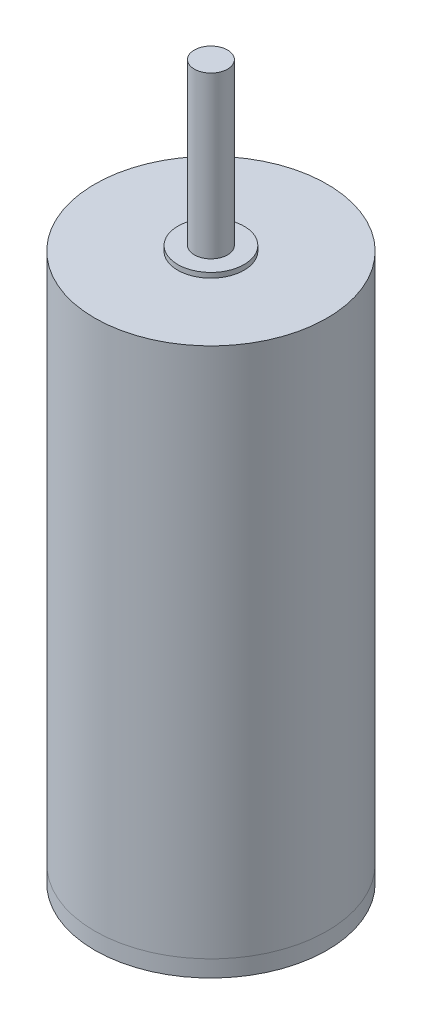
ISO-10303-21;
HEADER;
FILE_DESCRIPTION(('STEP AP214'),'2;1');
FILE_NAME('part.step','',(''),(''),'','','');
FILE_SCHEMA(('AUTOMOTIVE_DESIGN { 1 0 10303 214 1 1 1 1 }'));
ENDSEC;
DATA;
#1=APPLICATION_CONTEXT('core data for automotive mechanical design processes');
#2=APPLICATION_PROTOCOL_DEFINITION('international standard','automotive_design',2000,#1);
#3=PRODUCT_CONTEXT('',#1,'mechanical');
#4=PRODUCT('Part','Part','',(#3));
#5=PRODUCT_RELATED_PRODUCT_CATEGORY('part','',(#4));
#6=PRODUCT_DEFINITION_FORMATION('','',#4);
#7=PRODUCT_DEFINITION_CONTEXT('part definition',#1,'design');
#8=PRODUCT_DEFINITION('design','',#6,#7);
#9=PRODUCT_DEFINITION_SHAPE('','',#8);
#10=(LENGTH_UNIT() NAMED_UNIT(*) SI_UNIT(.MILLI.,.METRE.));
#11=(NAMED_UNIT(*) PLANE_ANGLE_UNIT() SI_UNIT($,.RADIAN.));
#12=(NAMED_UNIT(*) SI_UNIT($,.STERADIAN.) SOLID_ANGLE_UNIT());
#13=UNCERTAINTY_MEASURE_WITH_UNIT(LENGTH_MEASURE(1.E-05),#10,'distance_accuracy_value','');
#14=(GEOMETRIC_REPRESENTATION_CONTEXT(3) GLOBAL_UNCERTAINTY_ASSIGNED_CONTEXT((#13)) GLOBAL_UNIT_ASSIGNED_CONTEXT((#10,
#11,#12)) REPRESENTATION_CONTEXT('',''));
#15=CARTESIAN_POINT('',(0.,0.,0.));
#16=DIRECTION('',(0.,0.,1.));
#17=DIRECTION('',(1.,0.,0.));
#18=AXIS2_PLACEMENT_3D('',#15,#16,#17);
#19=CARTESIAN_POINT('',(0.,-0.5,0.));
#20=DIRECTION('',(0.,1.,0.));
#21=DIRECTION('',(0.,0.,1.));
#22=AXIS2_PLACEMENT_3D('',#19,#20,#21);
#23=CYLINDRICAL_SURFACE('',#22,3.5);
#24=CARTESIAN_POINT('',(0.,-0.5,0.));
#25=DIRECTION('',(0.,1.,0.));
#26=DIRECTION('',(0.,0.,1.));
#27=AXIS2_PLACEMENT_3D('',#24,#25,#26);
#28=CIRCLE('',#27,3.5);
#29=CARTESIAN_POINT('',(0.,-0.5,3.5));
#30=VERTEX_POINT('',#29);
#31=EDGE_CURVE('E11',#30,#30,#28,.T.);
#32=ORIENTED_EDGE('',*,*,#31,.T.);
#33=EDGE_LOOP('',(#32));
#34=FACE_BOUND('',#33,.T.);
#35=CARTESIAN_POINT('',(0.,0.,0.));
#36=DIRECTION('',(0.,1.,0.));
#37=DIRECTION('',(0.,0.,1.));
#38=AXIS2_PLACEMENT_3D('',#35,#36,#37);
#39=CIRCLE('',#38,3.5);
#40=CARTESIAN_POINT('',(0.,0.,3.5));
#41=VERTEX_POINT('',#40);
#42=EDGE_CURVE('E50',#41,#41,#39,.T.);
#43=ORIENTED_EDGE('',*,*,#42,.F.);
#44=EDGE_LOOP('',(#43));
#45=FACE_BOUND('',#44,.T.);
#46=ADVANCED_FACE('F47',(#34,#45),#23,.T.);
#47=CARTESIAN_POINT('',(0.,-0.5,0.));
#48=DIRECTION('',(0.,1.,0.));
#49=DIRECTION('',(0.,0.,1.));
#50=AXIS2_PLACEMENT_3D('',#47,#48,#49);
#51=PLANE('',#50);
#52=ORIENTED_EDGE('',*,*,#31,.F.);
#53=EDGE_LOOP('',(#52));
#54=FACE_BOUND('',#53,.T.);
#55=ADVANCED_FACE('F62',(#54),#51,.F.);
#56=CARTESIAN_POINT('',(0.,0.,0.));
#57=DIRECTION('',(0.,1.,0.));
#58=DIRECTION('',(0.,0.,1.));
#59=AXIS2_PLACEMENT_3D('',#56,#57,#58);
#60=PLANE('',#59);
#61=ORIENTED_EDGE('',*,*,#42,.T.);
#62=EDGE_LOOP('',(#61));
#63=FACE_BOUND('',#62,.T.);
#64=ADVANCED_FACE('F59',(#63),#60,.T.);
#65=CLOSED_SHELL('',(#46,#55,#64));
#66=MANIFOLD_SOLID_BREP('B2',#65);
#67=CARTESIAN_POINT('',(0.,16.,0.));
#68=DIRECTION('',(0.,-1.,0.));
#69=DIRECTION('',(0.,0.,-1.));
#70=AXIS2_PLACEMENT_3D('',#67,#68,#69);
#71=CYLINDRICAL_SURFACE('',#70,3.5);
#72=CARTESIAN_POINT('',(0.,16.,0.));
#73=DIRECTION('',(0.,1.,0.));
#74=DIRECTION('',(0.,0.,1.));
#75=AXIS2_PLACEMENT_3D('',#72,#73,#74);
#76=CIRCLE('',#75,3.5);
#77=CARTESIAN_POINT('',(0.,16.,3.5));
#78=VERTEX_POINT('',#77);
#79=EDGE_CURVE('E46',#78,#78,#76,.T.);
#80=ORIENTED_EDGE('',*,*,#79,.F.);
#81=EDGE_LOOP('',(#80));
#82=FACE_BOUND('',#81,.T.);
#83=CARTESIAN_POINT('',(0.,0.,0.));
#84=DIRECTION('',(0.,1.,0.));
#85=DIRECTION('',(0.,0.,1.));
#86=AXIS2_PLACEMENT_3D('',#83,#84,#85);
#87=CIRCLE('',#86,3.5);
#88=CARTESIAN_POINT('',(0.,0.,3.5));
#89=VERTEX_POINT('',#88);
#90=EDGE_CURVE('E95',#89,#89,#87,.T.);
#91=ORIENTED_EDGE('',*,*,#90,.T.);
#92=EDGE_LOOP('',(#91));
#93=FACE_BOUND('',#92,.T.);
#94=ADVANCED_FACE('F87',(#82,#93),#71,.T.);
#95=CARTESIAN_POINT('',(0.,16.,0.));
#96=DIRECTION('',(0.,1.,0.));
#97=DIRECTION('',(0.,0.,1.));
#98=AXIS2_PLACEMENT_3D('',#95,#96,#97);
#99=PLANE('',#98);
#100=CARTESIAN_POINT('',(0.,16.,0.));
#101=DIRECTION('',(0.,1.,0.));
#102=DIRECTION('',(0.,0.,1.));
#103=AXIS2_PLACEMENT_3D('',#100,#101,#102);
#104=CIRCLE('',#103,1.);
#105=CARTESIAN_POINT('',(0.,16.,1.));
#106=VERTEX_POINT('',#105);
#107=EDGE_CURVE('E106',#106,#106,#104,.T.);
#108=ORIENTED_EDGE('',*,*,#107,.F.);
#109=EDGE_LOOP('',(#108));
#110=FACE_BOUND('',#109,.T.);
#111=ORIENTED_EDGE('',*,*,#79,.T.);
#112=EDGE_LOOP('',(#111));
#113=FACE_BOUND('',#112,.T.);
#114=ADVANCED_FACE('F137',(#110,#113),#99,.T.);
#115=CARTESIAN_POINT('',(0.,0.,0.));
#116=DIRECTION('',(0.,1.,0.));
#117=DIRECTION('',(0.,0.,1.));
#118=AXIS2_PLACEMENT_3D('',#115,#116,#117);
#119=PLANE('',#118);
#120=ORIENTED_EDGE('',*,*,#90,.F.);
#121=EDGE_LOOP('',(#120));
#122=FACE_BOUND('',#121,.T.);
#123=ADVANCED_FACE('F133',(#122),#119,.F.);
#124=CARTESIAN_POINT('',(0.,16.15,0.));
#125=DIRECTION('',(0.,-1.,0.));
#126=DIRECTION('',(0.,0.,-1.));
#127=AXIS2_PLACEMENT_3D('',#124,#125,#126);
#128=CYLINDRICAL_SURFACE('',#127,1.);
#129=CARTESIAN_POINT('',(0.,16.15,0.));
#130=DIRECTION('',(0.,1.,0.));
#131=DIRECTION('',(0.,0.,1.));
#132=AXIS2_PLACEMENT_3D('',#129,#130,#131);
#133=CIRCLE('',#132,1.);
#134=CARTESIAN_POINT('',(0.,16.15,1.));
#135=VERTEX_POINT('',#134);
#136=EDGE_CURVE('E110',#135,#135,#133,.T.);
#137=ORIENTED_EDGE('',*,*,#136,.F.);
#138=EDGE_LOOP('',(#137));
#139=FACE_BOUND('',#138,.T.);
#140=ORIENTED_EDGE('',*,*,#107,.T.);
#141=EDGE_LOOP('',(#140));
#142=FACE_BOUND('',#141,.T.);
#143=ADVANCED_FACE('F125',(#139,#142),#128,.T.);
#144=CARTESIAN_POINT('',(0.,16.15,0.));
#145=DIRECTION('',(0.,1.,0.));
#146=DIRECTION('',(0.,0.,1.));
#147=AXIS2_PLACEMENT_3D('',#144,#145,#146);
#148=PLANE('',#147);
#149=CARTESIAN_POINT('',(0.,16.15,0.));
#150=DIRECTION('',(0.,1.,0.));
#151=DIRECTION('',(0.,0.,1.));
#152=AXIS2_PLACEMENT_3D('',#149,#150,#151);
#153=CIRCLE('',#152,0.5);
#154=CARTESIAN_POINT('',(0.,16.15,0.5));
#155=VERTEX_POINT('',#154);
#156=EDGE_CURVE('E90',#155,#155,#153,.T.);
#157=ORIENTED_EDGE('',*,*,#156,.F.);
#158=EDGE_LOOP('',(#157));
#159=FACE_BOUND('',#158,.T.);
#160=ORIENTED_EDGE('',*,*,#136,.T.);
#161=EDGE_LOOP('',(#160));
#162=FACE_BOUND('',#161,.T.);
#163=ADVANCED_FACE('F122',(#159,#162),#148,.T.);
#164=CARTESIAN_POINT('',(0.,21.,0.));
#165=DIRECTION('',(0.,1.,0.));
#166=DIRECTION('',(0.,0.,1.));
#167=AXIS2_PLACEMENT_3D('',#164,#165,#166);
#168=PLANE('',#167);
#169=CARTESIAN_POINT('',(0.,21.,0.));
#170=DIRECTION('',(0.,1.,0.));
#171=DIRECTION('',(0.,0.,1.));
#172=AXIS2_PLACEMENT_3D('',#169,#170,#171);
#173=CIRCLE('',#172,0.5);
#174=CARTESIAN_POINT('',(0.,21.,0.5));
#175=VERTEX_POINT('',#174);
#176=EDGE_CURVE('E101',#175,#175,#173,.T.);
#177=ORIENTED_EDGE('',*,*,#176,.T.);
#178=EDGE_LOOP('',(#177));
#179=FACE_BOUND('',#178,.T.);
#180=ADVANCED_FACE('F124',(#179),#168,.T.);
#181=CARTESIAN_POINT('',(0.,21.,0.));
#182=DIRECTION('',(0.,-1.,0.));
#183=DIRECTION('',(0.,0.,-1.));
#184=AXIS2_PLACEMENT_3D('',#181,#182,#183);
#185=CYLINDRICAL_SURFACE('',#184,0.5);
#186=ORIENTED_EDGE('',*,*,#156,.T.);
#187=EDGE_LOOP('',(#186));
#188=FACE_BOUND('',#187,.T.);
#189=ORIENTED_EDGE('',*,*,#176,.F.);
#190=EDGE_LOOP('',(#189));
#191=FACE_BOUND('',#190,.T.);
#192=ADVANCED_FACE('F119',(#188,#191),#185,.T.);
#193=CLOSED_SHELL('',(#94,#114,#123,#143,#163,#180,#192));
#194=MANIFOLD_SOLID_BREP('B6',#193);
#195=ADVANCED_BREP_SHAPE_REPRESENTATION('',(#18,#66,#194),#14);
#196=SHAPE_DEFINITION_REPRESENTATION(#9,#195);
ENDSEC;
END-ISO-10303-21;
